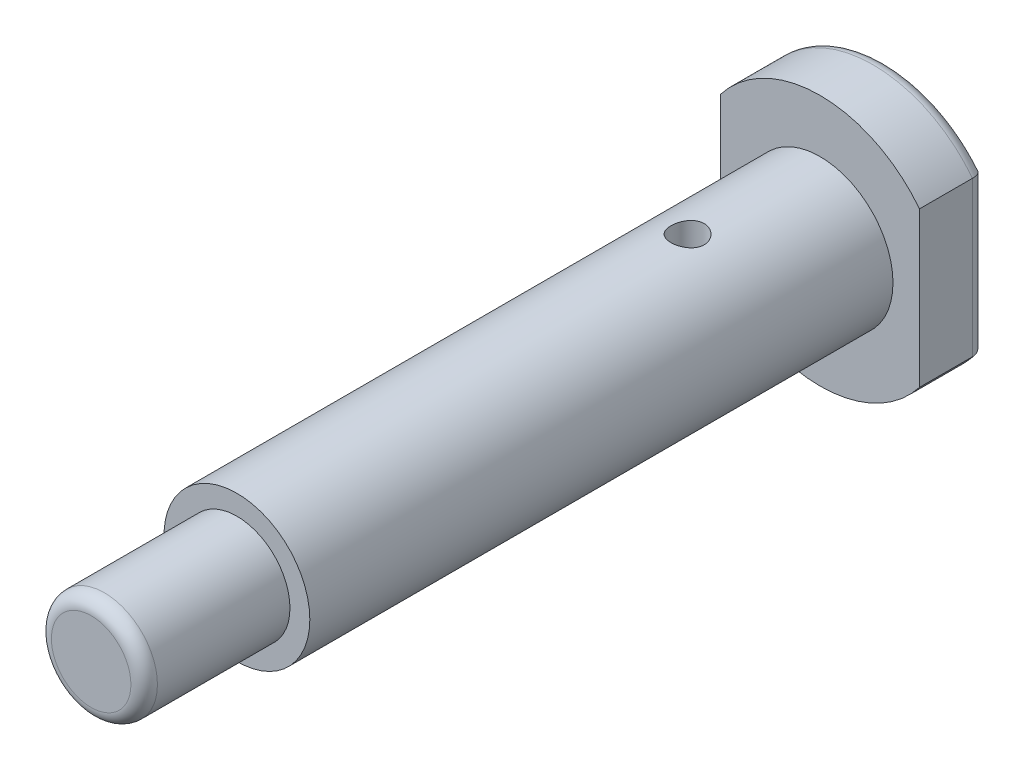
ISO-10303-21;
HEADER;
FILE_DESCRIPTION(('STEP AP214'),'2;1');
FILE_NAME('part.step','',(''),(''),'','','');
FILE_SCHEMA(('AUTOMOTIVE_DESIGN { 1 0 10303 214 1 1 1 1 }'));
ENDSEC;
DATA;
#1=APPLICATION_CONTEXT('core data for automotive mechanical design processes');
#2=APPLICATION_PROTOCOL_DEFINITION('international standard','automotive_design',2000,#1);
#3=PRODUCT_CONTEXT('',#1,'mechanical');
#4=PRODUCT('Part','Part','',(#3));
#5=PRODUCT_RELATED_PRODUCT_CATEGORY('part','',(#4));
#6=PRODUCT_DEFINITION_FORMATION('','',#4);
#7=PRODUCT_DEFINITION_CONTEXT('part definition',#1,'design');
#8=PRODUCT_DEFINITION('design','',#6,#7);
#9=PRODUCT_DEFINITION_SHAPE('','',#8);
#10=(LENGTH_UNIT() NAMED_UNIT(*) SI_UNIT(.MILLI.,.METRE.));
#11=(NAMED_UNIT(*) PLANE_ANGLE_UNIT() SI_UNIT($,.RADIAN.));
#12=(NAMED_UNIT(*) SI_UNIT($,.STERADIAN.) SOLID_ANGLE_UNIT());
#13=UNCERTAINTY_MEASURE_WITH_UNIT(LENGTH_MEASURE(1.E-05),#10,'distance_accuracy_value','');
#14=(GEOMETRIC_REPRESENTATION_CONTEXT(3) GLOBAL_UNCERTAINTY_ASSIGNED_CONTEXT((#13)) GLOBAL_UNIT_ASSIGNED_CONTEXT((#10,
#11,#12)) REPRESENTATION_CONTEXT('',''));
#15=CARTESIAN_POINT('',(0.,0.,0.));
#16=DIRECTION('',(0.,0.,1.));
#17=DIRECTION('',(1.,0.,0.));
#18=AXIS2_PLACEMENT_3D('',#15,#16,#17);
#19=CARTESIAN_POINT('',(-32.8522446417878,0.,120.));
#20=DIRECTION('',(0.,0.,-1.));
#21=DIRECTION('',(-1.,0.,0.));
#22=AXIS2_PLACEMENT_3D('',#19,#20,#21);
#23=CYLINDRICAL_SURFACE('',#22,8.);
#24=CARTESIAN_POINT('',(-32.8522446417878,0.,118.));
#25=DIRECTION('',(0.,0.,1.));
#26=DIRECTION('',(1.,0.,0.));
#27=AXIS2_PLACEMENT_3D('',#24,#25,#26);
#28=CIRCLE('',#27,8.);
#29=CARTESIAN_POINT('',(-24.8522446417878,0.,118.));
#30=VERTEX_POINT('',#29);
#31=EDGE_CURVE('E49',#30,#30,#28,.F.);
#32=ORIENTED_EDGE('',*,*,#31,.T.);
#33=EDGE_LOOP('',(#32));
#34=FACE_BOUND('',#33,.T.);
#35=CARTESIAN_POINT('',(-32.8522446417878,0.,98.));
#36=DIRECTION('',(0.,0.,1.));
#37=DIRECTION('',(1.,0.,0.));
#38=AXIS2_PLACEMENT_3D('',#35,#36,#37);
#39=CIRCLE('',#38,8.);
#40=CARTESIAN_POINT('',(-24.8522446417878,0.,98.));
#41=VERTEX_POINT('',#40);
#42=EDGE_CURVE('E139',#41,#41,#39,.T.);
#43=ORIENTED_EDGE('',*,*,#42,.T.);
#44=EDGE_LOOP('',(#43));
#45=FACE_BOUND('',#44,.T.);
#46=ADVANCED_FACE('F36',(#34,#45),#23,.T.);
#47=CARTESIAN_POINT('',(0.,0.,120.));
#48=DIRECTION('',(0.,0.,1.));
#49=DIRECTION('',(1.,0.,0.));
#50=AXIS2_PLACEMENT_3D('',#47,#48,#49);
#51=PLANE('',#50);
#52=CARTESIAN_POINT('',(-32.8522446417878,0.,120.));
#53=DIRECTION('',(0.,0.,1.));
#54=DIRECTION('',(1.,0.,0.));
#55=AXIS2_PLACEMENT_3D('',#52,#53,#54);
#56=CIRCLE('',#55,6.);
#57=CARTESIAN_POINT('',(-26.8522446417878,0.,120.));
#58=VERTEX_POINT('',#57);
#59=EDGE_CURVE('E156',#58,#58,#56,.T.);
#60=ORIENTED_EDGE('',*,*,#59,.T.);
#61=EDGE_LOOP('',(#60));
#62=FACE_BOUND('',#61,.T.);
#63=ADVANCED_FACE('F225',(#62),#51,.T.);
#64=CARTESIAN_POINT('',(-32.8522446417878,0.,98.));
#65=DIRECTION('',(0.,0.,-1.));
#66=DIRECTION('',(-1.,0.,0.));
#67=AXIS2_PLACEMENT_3D('',#64,#65,#66);
#68=CYLINDRICAL_SURFACE('',#67,11.);
#69=CARTESIAN_POINT('',(-32.8522446417878,-11.,32.5));
#70=CARTESIAN_POINT('',(-32.7137263631909,-10.9999974735185,32.4999954681736));
#71=CARTESIAN_POINT('',(-32.5751544695298,-10.9973570934613,32.4884487724231));
#72=CARTESIAN_POINT('',(-32.3019560471885,-10.987079320306,32.4426205239383));
#73=CARTESIAN_POINT('',(-32.1673322495671,-10.9794385496265,32.4083236040447));
#74=CARTESIAN_POINT('',(-31.9060169698029,-10.9600095312294,32.3181319513681));
#75=CARTESIAN_POINT('',(-31.7793170468314,-10.9482257885674,32.2622606720193));
#76=CARTESIAN_POINT('',(-31.5370923659622,-10.921778201627,32.1305828866191));
#77=CARTESIAN_POINT('',(-31.421567496756,-10.9071143860398,32.0547765791576));
#78=CARTESIAN_POINT('',(-31.2029770373414,-10.8762265816814,31.8839979553933));
#79=CARTESIAN_POINT('',(-31.1001317028673,-10.8599819758326,31.788747426525));
#80=CARTESIAN_POINT('',(-30.9117307436217,-10.827906511833,31.5823810258627));
#81=CARTESIAN_POINT('',(-30.82617676057,-10.8120756930933,31.4712636493055));
#82=CARTESIAN_POINT('',(-30.67379864777,-10.7824158369221,31.2346679447163));
#83=CARTESIAN_POINT('',(-30.6072120982221,-10.7686131580577,31.1090330036942));
#84=CARTESIAN_POINT('',(-30.4961839446091,-10.7448696147509,30.8479904994184));
#85=CARTESIAN_POINT('',(-30.4517394646103,-10.7349282488168,30.7125842079384));
#86=CARTESIAN_POINT('',(-30.3869911476606,-10.7202434469831,30.4382408128835));
#87=CARTESIAN_POINT('',(-30.3662957149803,-10.715415797339,30.2994007368775));
#88=CARTESIAN_POINT('',(-30.348414757273,-10.7112523406768,30.0201417727869));
#89=CARTESIAN_POINT('',(-30.3512261029223,-10.711915802658,29.8797230973377));
#90=CARTESIAN_POINT('',(-30.3799644722002,-10.7185835035919,29.6042271166513));
#91=CARTESIAN_POINT('',(-30.4054335957934,-10.7244819412976,29.4690990938051));
#92=CARTESIAN_POINT('',(-30.4780377925828,-10.7407873672743,29.2050855138452));
#93=CARTESIAN_POINT('',(-30.5251741677449,-10.7511946264744,29.0762003323728));
#94=CARTESIAN_POINT('',(-30.6401872977624,-10.7754474384537,28.8270593281895));
#95=CARTESIAN_POINT('',(-30.7082375209277,-10.7893215597825,28.7068864822363));
#96=CARTESIAN_POINT('',(-30.8630248625837,-10.8189276843241,28.4794974468889));
#97=CARTESIAN_POINT('',(-30.9497647194165,-10.8346599596346,28.3722831597361));
#98=CARTESIAN_POINT('',(-31.1418794617527,-10.8666615287251,28.171221438179));
#99=CARTESIAN_POINT('',(-31.2476429743595,-10.882934773515,28.0777455734837));
#100=CARTESIAN_POINT('',(-31.4735323433781,-10.9138502597158,27.9097941112929));
#101=CARTESIAN_POINT('',(-31.593658501697,-10.9284924668293,27.8353189133005));
#102=CARTESIAN_POINT('',(-31.8453366499887,-10.9545497424637,27.7073796120285));
#103=CARTESIAN_POINT('',(-31.9769158074397,-10.9659568484873,27.6539672263777));
#104=CARTESIAN_POINT('',(-32.2474995192961,-10.9841998956698,27.5701159941321));
#105=CARTESIAN_POINT('',(-32.3865029021241,-10.9910365557784,27.5396735341778));
#106=CARTESIAN_POINT('',(-32.6648048015951,-10.9992650071756,27.5031737625273));
#107=CARTESIAN_POINT('',(-32.8040335494508,-11.0007700184113,27.4966093086833));
#108=CARTESIAN_POINT('',(-33.0815985284679,-10.9984842255063,27.5066730398529));
#109=CARTESIAN_POINT('',(-33.2199348245087,-10.9946938107912,27.523299519406));
#110=CARTESIAN_POINT('',(-33.4900863190063,-10.9823148103741,27.5788531669054));
#111=CARTESIAN_POINT('',(-33.6219596786022,-10.973784087055,27.6175115464437));
#112=CARTESIAN_POINT('',(-33.8773485726654,-10.9528806132367,27.7157310274571));
#113=CARTESIAN_POINT('',(-34.0008633561107,-10.9405075180554,27.7752940042533));
#114=CARTESIAN_POINT('',(-34.2381054943484,-10.9130143275095,27.9146691435553));
#115=CARTESIAN_POINT('',(-34.351655327015,-10.8978552985532,27.9947756267732));
#116=CARTESIAN_POINT('',(-34.5638823775783,-10.866546095646,28.1725793284402));
#117=CARTESIAN_POINT('',(-34.6625574953675,-10.8503957821912,28.2702790265468));
#118=CARTESIAN_POINT('',(-34.8442617039688,-10.8185287714487,28.4828309651334));
#119=CARTESIAN_POINT('',(-34.9269383077284,-10.8028272119253,28.5979872417868));
#120=CARTESIAN_POINT('',(-35.0717827858533,-10.7740023321604,28.8408463906703));
#121=CARTESIAN_POINT('',(-35.133951566798,-10.7608788979592,28.9685487079596));
#122=CARTESIAN_POINT('',(-35.2355806142071,-10.7388274870674,29.2321804695689));
#123=CARTESIAN_POINT('',(-35.2751718040049,-10.7298753781702,29.3680573237433));
#124=CARTESIAN_POINT('',(-35.3308972251915,-10.7171411058581,29.6447669066991));
#125=CARTESIAN_POINT('',(-35.347035555204,-10.7133580391079,29.7855987651364));
#126=CARTESIAN_POINT('',(-35.3552120339295,-10.7114502943222,30.0646586193109));
#127=CARTESIAN_POINT('',(-35.3478101267985,-10.7131941458177,30.2028695993336));
#128=CARTESIAN_POINT('',(-35.3103757958206,-10.7218446846914,30.4760189101883));
#129=CARTESIAN_POINT('',(-35.2803436839579,-10.7287513008948,30.6109572861105));
#130=CARTESIAN_POINT('',(-35.1987815653939,-10.7468826027048,30.8732433973663));
#131=CARTESIAN_POINT('',(-35.1473392170678,-10.758089666867,31.0006196911415));
#132=CARTESIAN_POINT('',(-35.0244900078566,-10.783564723281,31.2450147069006));
#133=CARTESIAN_POINT('',(-34.9530808791,-10.7978330631966,31.3620322503255));
#134=CARTESIAN_POINT('',(-34.7904946106983,-10.828211072634,31.5851344276553));
#135=CARTESIAN_POINT('',(-34.6989210982162,-10.8443540558786,31.6909257222074));
#136=CARTESIAN_POINT('',(-34.499400931112,-10.8764454859305,31.8858231850819));
#137=CARTESIAN_POINT('',(-34.3914504771946,-10.8923938866665,31.974925470966));
#138=CARTESIAN_POINT('',(-34.1603852469384,-10.9225693389041,32.1351380602337));
#139=CARTESIAN_POINT('',(-34.037076263664,-10.9367686161711,32.2059738233331));
#140=CARTESIAN_POINT('',(-33.7800006094995,-10.9615640551399,32.3257999706629));
#141=CARTESIAN_POINT('',(-33.6462424861255,-10.9721631246672,32.3748079947867));
#142=CARTESIAN_POINT('',(-33.4024077133274,-10.9867559512784,32.4412279061761));
#143=CARTESIAN_POINT('',(-33.2936127529263,-10.9916908558499,32.4632239876893));
#144=CARTESIAN_POINT('',(-33.0739714567187,-10.9983138080738,32.4926114735793));
#145=CARTESIAN_POINT('',(-32.9631252265049,-11.0000020223883,32.5000036276192));
#146=CARTESIAN_POINT('',(-32.8522446417878,-11.,32.5));
#147=B_SPLINE_CURVE_WITH_KNOTS('',3,(#69,#70,#71,#72,#73,#74,#75,#76,#77,#78,#79,#80,#81,#82,
#83,#84,#85,#86,#87,#88,#89,#90,#91,#92,#93,#94,#95,#96,#97,#98,#99,#100,#101,#102,#103,#104,
#105,#106,#107,#108,#109,#110,#111,#112,#113,#114,#115,#116,#117,#118,#119,#120,#121,#122,#123,
#124,#125,#126,#127,#128,#129,#130,#131,#132,#133,#134,#135,#136,#137,#138,#139,#140,#141,#142,
#143,#144,#145,#146),.UNSPECIFIED.,.T.,.F.,(4,2,2,2,2,2,2,2,2,2,2,2,2,2,2,2,2,2,2,2,2,2,2,2,2,2,
2,2,2,2,2,2,2,2,2,2,2,2,4),(0.,0.415148849633316,0.830578406996924,1.24555761755318,
1.66053269430524,2.08192389396808,2.50335508365802,2.92985362973413,3.35629676538238,
3.77560244898081,4.19485231368756,4.60581714174234,5.0168066675397,5.43130157438849,
5.84585725297977,6.27011531803702,6.69438230269861,7.11968464096645,7.54492006169894,
7.96106941916761,8.37718817463626,8.78833576149034,9.19952024123082,9.61696129328766,
10.0344612272567,10.4603132154039,10.8861463755948,11.3094844190899,11.732748471094,
12.1460204395145,12.5592867105953,12.9708773657614,13.382514789318,13.8031102578591,
14.2238034502007,14.6504927745346,15.0768366452215,15.4091704772436,15.74148724914),.UNSPECIFIED.);
#148=CARTESIAN_POINT('',(-32.8522446417878,-11.,32.5));
#149=VERTEX_POINT('',#148);
#150=EDGE_CURVE('E40',#149,#149,#147,.T.);
#151=ORIENTED_EDGE('',*,*,#150,.T.);
#152=EDGE_LOOP('',(#151));
#153=FACE_BOUND('',#152,.T.);
#154=CARTESIAN_POINT('',(-32.8522446417878,11.,32.5));
#155=CARTESIAN_POINT('',(-32.9907629203847,10.9999974735185,32.4999954681736));
#156=CARTESIAN_POINT('',(-33.1293348140458,10.9973570934613,32.4884487724231));
#157=CARTESIAN_POINT('',(-33.4025332363871,10.987079320306,32.4426205239383));
#158=CARTESIAN_POINT('',(-33.5371570340085,10.9794385496265,32.4083236040447));
#159=CARTESIAN_POINT('',(-33.7984723137727,10.9600095312294,32.3181319513681));
#160=CARTESIAN_POINT('',(-33.9251722367443,10.9482257885674,32.2622606720193));
#161=CARTESIAN_POINT('',(-34.1673969176135,10.921778201627,32.1305828866191));
#162=CARTESIAN_POINT('',(-34.2829217868196,10.9071143860398,32.0547765791576));
#163=CARTESIAN_POINT('',(-34.5015122462342,10.8762265816814,31.8839979553933));
#164=CARTESIAN_POINT('',(-34.6043575807083,10.8599819758326,31.788747426525));
#165=CARTESIAN_POINT('',(-34.7927585399539,10.827906511833,31.5823810258628));
#166=CARTESIAN_POINT('',(-34.8783125230057,10.8120756930933,31.4712636493055));
#167=CARTESIAN_POINT('',(-35.0306906358057,10.7824158369221,31.2346679447163));
#168=CARTESIAN_POINT('',(-35.0972771853536,10.7686131580577,31.1090330036942));
#169=CARTESIAN_POINT('',(-35.2083053389665,10.7448696147509,30.8479904994184));
#170=CARTESIAN_POINT('',(-35.2527498189653,10.7349282488168,30.7125842079384));
#171=CARTESIAN_POINT('',(-35.317498135915,10.7202434469831,30.4382408128835));
#172=CARTESIAN_POINT('',(-35.3381935685954,10.715415797339,30.2994007368775));
#173=CARTESIAN_POINT('',(-35.3560745263027,10.7112523406768,30.0201417727869));
#174=CARTESIAN_POINT('',(-35.3532631806533,10.711915802658,29.8797230973377));
#175=CARTESIAN_POINT('',(-35.3245248113754,10.7185835035919,29.6042271166513));
#176=CARTESIAN_POINT('',(-35.2990556877822,10.7244819412976,29.4690990938051));
#177=CARTESIAN_POINT('',(-35.2264514909928,10.7407873672743,29.2050855138452));
#178=CARTESIAN_POINT('',(-35.1793151158307,10.7511946264744,29.0762003323728));
#179=CARTESIAN_POINT('',(-35.0643019858133,10.7754474384537,28.8270593281895));
#180=CARTESIAN_POINT('',(-34.9962517626479,10.7893215597825,28.7068864822363));
#181=CARTESIAN_POINT('',(-34.8414644209919,10.8189276843241,28.4794974468889));
#182=CARTESIAN_POINT('',(-34.7547245641592,10.8346599596346,28.3722831597361));
#183=CARTESIAN_POINT('',(-34.562609821823,10.8666615287251,28.171221438179));
#184=CARTESIAN_POINT('',(-34.4568463092161,10.882934773515,28.0777455734837));
#185=CARTESIAN_POINT('',(-34.2309569401975,10.9138502597158,27.9097941112929));
#186=CARTESIAN_POINT('',(-34.1108307818786,10.9284924668293,27.8353189133005));
#187=CARTESIAN_POINT('',(-33.859152633587,10.9545497424637,27.7073796120285));
#188=CARTESIAN_POINT('',(-33.727573476136,10.9659568484873,27.6539672263777));
#189=CARTESIAN_POINT('',(-33.4569897642795,10.9841998956698,27.5701159941321));
#190=CARTESIAN_POINT('',(-33.3179863814515,10.9910365557784,27.5396735341778));
#191=CARTESIAN_POINT('',(-33.0396844819806,10.9992650071756,27.5031737625273));
#192=CARTESIAN_POINT('',(-32.9004557341249,11.0007700184113,27.4966093086833));
#193=CARTESIAN_POINT('',(-32.6228907551077,10.9984842255063,27.5066730398529));
#194=CARTESIAN_POINT('',(-32.484554459067,10.9946938107912,27.523299519406));
#195=CARTESIAN_POINT('',(-32.2144029645694,10.9823148103741,27.5788531669054));
#196=CARTESIAN_POINT('',(-32.0825296049734,10.973784087055,27.6175115464437));
#197=CARTESIAN_POINT('',(-31.8271407109102,10.9528806132367,27.7157310274571));
#198=CARTESIAN_POINT('',(-31.7036259274649,10.9405075180554,27.7752940042533));
#199=CARTESIAN_POINT('',(-31.4663837892273,10.9130143275095,27.9146691435553));
#200=CARTESIAN_POINT('',(-31.3528339565606,10.8978552985532,27.9947756267732));
#201=CARTESIAN_POINT('',(-31.1406069059973,10.866546095646,28.1725793284402));
#202=CARTESIAN_POINT('',(-31.0419317882081,10.8503957821912,28.2702790265468));
#203=CARTESIAN_POINT('',(-30.8602275796069,10.8185287714487,28.4828309651334));
#204=CARTESIAN_POINT('',(-30.7775509758472,10.8028272119253,28.5979872417868));
#205=CARTESIAN_POINT('',(-30.6327064977223,10.7740023321604,28.8408463906703));
#206=CARTESIAN_POINT('',(-30.5705377167777,10.7608788979592,28.9685487079596));
#207=CARTESIAN_POINT('',(-30.4689086693685,10.7388274870674,29.2321804695689));
#208=CARTESIAN_POINT('',(-30.4293174795708,10.7298753781702,29.3680573237433));
#209=CARTESIAN_POINT('',(-30.3735920583842,10.7171411058581,29.6447669066991));
#210=CARTESIAN_POINT('',(-30.3574537283717,10.7133580391079,29.7855987651364));
#211=CARTESIAN_POINT('',(-30.3492772496462,10.7114502943222,30.0646586193109));
#212=CARTESIAN_POINT('',(-30.3566791567771,10.7131941458177,30.2028695993336));
#213=CARTESIAN_POINT('',(-30.394113487755,10.7218446846914,30.4760189101883));
#214=CARTESIAN_POINT('',(-30.4241455996177,10.7287513008948,30.6109572861105));
#215=CARTESIAN_POINT('',(-30.5057077181817,10.7468826027048,30.8732433973663));
#216=CARTESIAN_POINT('',(-30.5571500665079,10.758089666867,31.0006196911415));
#217=CARTESIAN_POINT('',(-30.679999275719,10.783564723281,31.2450147069006));
#218=CARTESIAN_POINT('',(-30.7514084044756,10.7978330631966,31.3620322503255));
#219=CARTESIAN_POINT('',(-30.9139946728773,10.828211072634,31.5851344276553));
#220=CARTESIAN_POINT('',(-31.0055681853595,10.8443540558786,31.6909257222074));
#221=CARTESIAN_POINT('',(-31.2050883524636,10.8764454859305,31.8858231850819));
#222=CARTESIAN_POINT('',(-31.3130388063811,10.8923938866665,31.974925470966));
#223=CARTESIAN_POINT('',(-31.5441040366373,10.9225693389041,32.1351380602337));
#224=CARTESIAN_POINT('',(-31.6674130199116,10.9367686161711,32.2059738233331));
#225=CARTESIAN_POINT('',(-31.9244886740761,10.9615640551399,32.3257999706629));
#226=CARTESIAN_POINT('',(-32.0582467974501,10.9721631246672,32.3748079947867));
#227=CARTESIAN_POINT('',(-32.3020815702482,10.9867559512784,32.4412279061761));
#228=CARTESIAN_POINT('',(-32.4108765306493,10.9916908558499,32.4632239876893));
#229=CARTESIAN_POINT('',(-32.6305178268569,10.9983138080738,32.4926114735793));
#230=CARTESIAN_POINT('',(-32.7413640570707,11.0000020223883,32.5000036276192));
#231=CARTESIAN_POINT('',(-32.8522446417878,11.,32.5));
#232=B_SPLINE_CURVE_WITH_KNOTS('',3,(#154,#155,#156,#157,#158,#159,#160,#161,#162,#163,#164,
#165,#166,#167,#168,#169,#170,#171,#172,#173,#174,#175,#176,#177,#178,#179,#180,#181,#182,#183,
#184,#185,#186,#187,#188,#189,#190,#191,#192,#193,#194,#195,#196,#197,#198,#199,#200,#201,#202,
#203,#204,#205,#206,#207,#208,#209,#210,#211,#212,#213,#214,#215,#216,#217,#218,#219,#220,#221,
#222,#223,#224,#225,#226,#227,#228,#229,#230,#231),.UNSPECIFIED.,.T.,.F.,(4,2,2,2,2,2,2,2,2,2,2,
2,2,2,2,2,2,2,2,2,2,2,2,2,2,2,2,2,2,2,2,2,2,2,2,2,2,2,4),(0.,0.415148849633316,
0.830578406996923,1.24555761755318,1.66053269430524,2.08192389396808,2.50335508365802,
2.92985362973414,3.35629676538239,3.77560244898081,4.19485231368757,4.60581714174234,
5.01680666753971,5.43130157438849,5.84585725297977,6.27011531803703,6.69438230269861,
7.11968464096647,7.54492006169894,7.96106941916761,8.37718817463626,8.78833576149035,
9.19952024123083,9.61696129328767,10.0344612272567,10.4603132154039,10.8861463755948,
11.3094844190899,11.732748471094,12.1460204395145,12.5592867105953,12.9708773657615,
13.382514789318,13.8031102578591,14.2238034502007,14.6504927745346,15.0768366452215,
15.4091704772436,15.74148724914),.UNSPECIFIED.);
#233=CARTESIAN_POINT('',(-32.8522446417878,11.,32.5));
#234=VERTEX_POINT('',#233);
#235=EDGE_CURVE('E11',#234,#234,#232,.T.);
#236=ORIENTED_EDGE('',*,*,#235,.T.);
#237=EDGE_LOOP('',(#236));
#238=FACE_BOUND('',#237,.T.);
#239=CARTESIAN_POINT('',(-32.8522446417878,0.,10.));
#240=DIRECTION('',(0.,0.,1.));
#241=DIRECTION('',(1.,0.,0.));
#242=AXIS2_PLACEMENT_3D('',#239,#240,#241);
#243=CIRCLE('',#242,11.);
#244=CARTESIAN_POINT('',(-21.8522446417878,0.,10.));
#245=VERTEX_POINT('',#244);
#246=EDGE_CURVE('E133',#245,#245,#243,.T.);
#247=ORIENTED_EDGE('',*,*,#246,.T.);
#248=EDGE_LOOP('',(#247));
#249=FACE_BOUND('',#248,.T.);
#250=CARTESIAN_POINT('',(-32.8522446417878,0.,98.));
#251=DIRECTION('',(0.,0.,1.));
#252=DIRECTION('',(1.,0.,0.));
#253=AXIS2_PLACEMENT_3D('',#250,#251,#252);
#254=CIRCLE('',#253,11.);
#255=CARTESIAN_POINT('',(-21.8522446417878,0.,98.));
#256=VERTEX_POINT('',#255);
#257=EDGE_CURVE('E136',#256,#256,#254,.T.);
#258=ORIENTED_EDGE('',*,*,#257,.F.);
#259=EDGE_LOOP('',(#258));
#260=FACE_BOUND('',#259,.T.);
#261=ADVANCED_FACE('F197',(#153,#238,#249,#260),#68,.T.);
#262=CARTESIAN_POINT('',(0.,0.,98.));
#263=DIRECTION('',(0.,0.,1.));
#264=DIRECTION('',(1.,0.,0.));
#265=AXIS2_PLACEMENT_3D('',#262,#263,#264);
#266=PLANE('',#265);
#267=ORIENTED_EDGE('',*,*,#257,.T.);
#268=EDGE_LOOP('',(#267));
#269=FACE_BOUND('',#268,.T.);
#270=ORIENTED_EDGE('',*,*,#42,.F.);
#271=EDGE_LOOP('',(#270));
#272=FACE_BOUND('',#271,.T.);
#273=ADVANCED_FACE('F219',(#269,#272),#266,.T.);
#274=CARTESIAN_POINT('',(-47.8522446417878,0.,10.));
#275=DIRECTION('',(-1.,0.,0.));
#276=DIRECTION('',(0.,0.,1.));
#277=AXIS2_PLACEMENT_3D('',#274,#275,#276);
#278=PLANE('',#277);
#279=DIRECTION('',(0.,0.,-1.));
#280=VECTOR('',#279,1.);
#281=CARTESIAN_POINT('',(-47.8522446417878,11.6619037896906,10.));
#282=LINE('',#281,#280);
#283=CARTESIAN_POINT('',(-47.8522446417878,11.6619037896906,10.));
#284=VERTEX_POINT('',#283);
#285=CARTESIAN_POINT('',(-47.8522446417878,11.6619037896906,2.));
#286=VERTEX_POINT('',#285);
#287=EDGE_CURVE('E129',#284,#286,#282,.T.);
#288=ORIENTED_EDGE('',*,*,#287,.T.);
#289=DIRECTION('',(0.,1.,0.));
#290=VECTOR('',#289,1.);
#291=CARTESIAN_POINT('',(-47.8522446417878,-11.6619037896906,2.));
#292=LINE('',#291,#290);
#293=CARTESIAN_POINT('',(-47.8522446417878,-11.6619037896906,2.));
#294=VERTEX_POINT('',#293);
#295=EDGE_CURVE('E114',#286,#294,#292,.F.);
#296=ORIENTED_EDGE('',*,*,#295,.T.);
#297=DIRECTION('',(0.,0.,-1.));
#298=VECTOR('',#297,1.);
#299=CARTESIAN_POINT('',(-47.8522446417878,-11.6619037896906,10.));
#300=LINE('',#299,#298);
#301=CARTESIAN_POINT('',(-47.8522446417878,-11.6619037896906,10.));
#302=VERTEX_POINT('',#301);
#303=EDGE_CURVE('E111',#302,#294,#300,.T.);
#304=ORIENTED_EDGE('',*,*,#303,.F.);
#305=DIRECTION('',(0.,1.,0.));
#306=VECTOR('',#305,1.);
#307=CARTESIAN_POINT('',(-47.8522446417878,0.,10.));
#308=LINE('',#307,#306);
#309=EDGE_CURVE('E97',#302,#284,#308,.T.);
#310=ORIENTED_EDGE('',*,*,#309,.T.);
#311=EDGE_LOOP('',(#288,#296,#304,#310));
#312=FACE_BOUND('',#311,.T.);
#313=ADVANCED_FACE('F112',(#312),#278,.T.);
#314=CARTESIAN_POINT('',(-17.8522446417878,0.,10.));
#315=DIRECTION('',(-1.,0.,0.));
#316=DIRECTION('',(0.,0.,1.));
#317=AXIS2_PLACEMENT_3D('',#314,#315,#316);
#318=PLANE('',#317);
#319=DIRECTION('',(0.,0.,-1.));
#320=VECTOR('',#319,1.);
#321=CARTESIAN_POINT('',(-17.8522446417878,-11.6619037896906,10.));
#322=LINE('',#321,#320);
#323=CARTESIAN_POINT('',(-17.8522446417878,-11.6619037896906,10.));
#324=VERTEX_POINT('',#323);
#325=CARTESIAN_POINT('',(-17.8522446417878,-11.6619037896906,2.));
#326=VERTEX_POINT('',#325);
#327=EDGE_CURVE('E118',#324,#326,#322,.T.);
#328=ORIENTED_EDGE('',*,*,#327,.T.);
#329=DIRECTION('',(0.,1.,0.));
#330=VECTOR('',#329,1.);
#331=CARTESIAN_POINT('',(-17.8522446417878,0.,2.));
#332=LINE('',#331,#330);
#333=CARTESIAN_POINT('',(-17.8522446417878,11.6619037896906,2.));
#334=VERTEX_POINT('',#333);
#335=EDGE_CURVE('E64',#326,#334,#332,.T.);
#336=ORIENTED_EDGE('',*,*,#335,.T.);
#337=DIRECTION('',(0.,0.,-1.));
#338=VECTOR('',#337,1.);
#339=CARTESIAN_POINT('',(-17.8522446417878,11.6619037896906,10.));
#340=LINE('',#339,#338);
#341=CARTESIAN_POINT('',(-17.8522446417878,11.6619037896906,10.));
#342=VERTEX_POINT('',#341);
#343=EDGE_CURVE('E108',#342,#334,#340,.T.);
#344=ORIENTED_EDGE('',*,*,#343,.F.);
#345=DIRECTION('',(0.,1.,0.));
#346=VECTOR('',#345,1.);
#347=CARTESIAN_POINT('',(-17.8522446417878,0.,10.));
#348=LINE('',#347,#346);
#349=EDGE_CURVE('E107',#324,#342,#348,.T.);
#350=ORIENTED_EDGE('',*,*,#349,.F.);
#351=EDGE_LOOP('',(#328,#336,#344,#350));
#352=FACE_BOUND('',#351,.T.);
#353=ADVANCED_FACE('F215',(#352),#318,.F.);
#354=CARTESIAN_POINT('',(0.,0.,10.));
#355=DIRECTION('',(0.,0.,1.));
#356=DIRECTION('',(1.,0.,0.));
#357=AXIS2_PLACEMENT_3D('',#354,#355,#356);
#358=PLANE('',#357);
#359=ORIENTED_EDGE('',*,*,#309,.F.);
#360=CARTESIAN_POINT('',(-32.8522446417878,0.,10.));
#361=DIRECTION('',(0.,0.,1.));
#362=DIRECTION('',(1.,0.,0.));
#363=AXIS2_PLACEMENT_3D('',#360,#361,#362);
#364=CIRCLE('',#363,19.);
#365=EDGE_CURVE('E102',#302,#324,#364,.T.);
#366=ORIENTED_EDGE('',*,*,#365,.T.);
#367=ORIENTED_EDGE('',*,*,#349,.T.);
#368=CARTESIAN_POINT('',(-32.8522446417878,0.,10.));
#369=DIRECTION('',(0.,0.,1.));
#370=DIRECTION('',(1.,0.,0.));
#371=AXIS2_PLACEMENT_3D('',#368,#369,#370);
#372=CIRCLE('',#371,19.);
#373=EDGE_CURVE('E105',#342,#284,#372,.T.);
#374=ORIENTED_EDGE('',*,*,#373,.T.);
#375=EDGE_LOOP('',(#359,#366,#367,#374));
#376=FACE_BOUND('',#375,.T.);
#377=ORIENTED_EDGE('',*,*,#246,.F.);
#378=EDGE_LOOP('',(#377));
#379=FACE_BOUND('',#378,.T.);
#380=ADVANCED_FACE('F99',(#376,#379),#358,.T.);
#381=CARTESIAN_POINT('',(0.,0.,0.));
#382=DIRECTION('',(0.,0.,1.));
#383=DIRECTION('',(1.,0.,0.));
#384=AXIS2_PLACEMENT_3D('',#381,#382,#383);
#385=PLANE('',#384);
#386=DIRECTION('',(0.,1.,0.));
#387=VECTOR('',#386,1.);
#388=CARTESIAN_POINT('',(-19.8522446417878,0.,0.));
#389=LINE('',#388,#387);
#390=CARTESIAN_POINT('',(-19.8522446417878,10.9544511501033,0.));
#391=VERTEX_POINT('',#390);
#392=CARTESIAN_POINT('',(-19.8522446417878,-10.9544511501033,0.));
#393=VERTEX_POINT('',#392);
#394=EDGE_CURVE('E148',#391,#393,#389,.F.);
#395=ORIENTED_EDGE('',*,*,#394,.T.);
#396=CARTESIAN_POINT('',(-32.8522446417878,0.,0.));
#397=DIRECTION('',(0.,0.,1.));
#398=DIRECTION('',(1.,0.,0.));
#399=AXIS2_PLACEMENT_3D('',#396,#397,#398);
#400=CIRCLE('',#399,17.);
#401=CARTESIAN_POINT('',(-45.8522446417878,-10.9544511501033,0.));
#402=VERTEX_POINT('',#401);
#403=EDGE_CURVE('E150',#393,#402,#400,.F.);
#404=ORIENTED_EDGE('',*,*,#403,.T.);
#405=DIRECTION('',(0.,1.,0.));
#406=VECTOR('',#405,1.);
#407=CARTESIAN_POINT('',(-45.8522446417878,11.6619037896906,0.));
#408=LINE('',#407,#406);
#409=CARTESIAN_POINT('',(-45.8522446417878,10.9544511501033,0.));
#410=VERTEX_POINT('',#409);
#411=EDGE_CURVE('E144',#402,#410,#408,.T.);
#412=ORIENTED_EDGE('',*,*,#411,.T.);
#413=CARTESIAN_POINT('',(-32.8522446417878,0.,0.));
#414=DIRECTION('',(0.,0.,1.));
#415=DIRECTION('',(1.,0.,0.));
#416=AXIS2_PLACEMENT_3D('',#413,#414,#415);
#417=CIRCLE('',#416,17.);
#418=EDGE_CURVE('E146',#410,#391,#417,.F.);
#419=ORIENTED_EDGE('',*,*,#418,.T.);
#420=EDGE_LOOP('',(#395,#404,#412,#419));
#421=FACE_BOUND('',#420,.T.);
#422=ADVANCED_FACE('F212',(#421),#385,.F.);
#423=CARTESIAN_POINT('',(-32.8522446417878,0.,10.));
#424=DIRECTION('',(0.,0.,-1.));
#425=DIRECTION('',(-1.,0.,0.));
#426=AXIS2_PLACEMENT_3D('',#423,#424,#425);
#427=CYLINDRICAL_SURFACE('',#426,19.);
#428=ORIENTED_EDGE('',*,*,#343,.T.);
#429=CARTESIAN_POINT('',(-32.8522446417878,0.,2.));
#430=DIRECTION('',(0.,0.,1.));
#431=DIRECTION('',(1.,0.,0.));
#432=AXIS2_PLACEMENT_3D('',#429,#430,#431);
#433=CIRCLE('',#432,19.);
#434=EDGE_CURVE('E56',#334,#286,#433,.T.);
#435=ORIENTED_EDGE('',*,*,#434,.T.);
#436=ORIENTED_EDGE('',*,*,#287,.F.);
#437=ORIENTED_EDGE('',*,*,#373,.F.);
#438=EDGE_LOOP('',(#428,#435,#436,#437));
#439=FACE_BOUND('',#438,.T.);
#440=ADVANCED_FACE('F209',(#439),#427,.T.);
#441=CARTESIAN_POINT('',(-32.8522446417878,0.,10.));
#442=DIRECTION('',(0.,0.,-1.));
#443=DIRECTION('',(-1.,0.,0.));
#444=AXIS2_PLACEMENT_3D('',#441,#442,#443);
#445=CYLINDRICAL_SURFACE('',#444,19.);
#446=ORIENTED_EDGE('',*,*,#303,.T.);
#447=CARTESIAN_POINT('',(-32.8522446417878,0.,2.));
#448=DIRECTION('',(0.,0.,1.));
#449=DIRECTION('',(1.,0.,0.));
#450=AXIS2_PLACEMENT_3D('',#447,#448,#449);
#451=CIRCLE('',#450,19.);
#452=EDGE_CURVE('E142',#294,#326,#451,.T.);
#453=ORIENTED_EDGE('',*,*,#452,.T.);
#454=ORIENTED_EDGE('',*,*,#327,.F.);
#455=ORIENTED_EDGE('',*,*,#365,.F.);
#456=EDGE_LOOP('',(#446,#453,#454,#455));
#457=FACE_BOUND('',#456,.T.);
#458=ADVANCED_FACE('F120',(#457),#445,.T.);
#459=CARTESIAN_POINT('',(-32.8522446417878,0.,2.));
#460=DIRECTION('',(0.,0.,1.));
#461=DIRECTION('',(1.,0.,0.));
#462=AXIS2_PLACEMENT_3D('',#459,#460,#461);
#463=TOROIDAL_SURFACE('',#462,17.,2.);
#464=CARTESIAN_POINT('',(-17.8522446417878,11.6619037896906,2.));
#465=CARTESIAN_POINT('',(-17.8522377637765,11.6619058462769,1.94598171971915));
#466=CARTESIAN_POINT('',(-17.854433012608,11.6611531769249,1.89196688865082));
#467=CARTESIAN_POINT('',(-17.8631749177118,11.6581543096388,1.78434023643365));
#468=CARTESIAN_POINT('',(-17.8697209116589,11.6559083390339,1.73072835519881));
#469=CARTESIAN_POINT('',(-17.8870930204596,11.6499451236759,1.62440008352148));
#470=CARTESIAN_POINT('',(-17.8979100141783,11.6462310142571,1.57168203282276));
#471=CARTESIAN_POINT('',(-17.9237113126995,11.6373659438458,1.4674140016757));
#472=CARTESIAN_POINT('',(-17.9386956498441,11.6322149717021,1.41586403029601));
#473=CARTESIAN_POINT('',(-17.9897131111544,11.6146627675983,1.26351051904033));
#474=CARTESIAN_POINT('',(-18.0318272094093,11.6001565947633,1.16490349655335));
#475=CARTESIAN_POINT('',(-18.1307369426246,11.5659998008216,0.976396320055426));
#476=CARTESIAN_POINT('',(-18.187535330986,11.5463482149073,0.88649780329705));
#477=CARTESIAN_POINT('',(-18.3153506369585,11.5019847666568,0.715640391958594));
#478=CARTESIAN_POINT('',(-18.3866517524167,11.4771714903434,0.63492044965898));
#479=CARTESIAN_POINT('',(-18.5404253697054,11.4234528370159,0.486541433308141));
#480=CARTESIAN_POINT('',(-18.6229014015198,11.3945461668311,0.418886502736701));
#481=CARTESIAN_POINT('',(-18.8011348030807,11.3318097138682,0.294844580377951));
#482=CARTESIAN_POINT('',(-18.8973569893139,11.2978032313887,0.239215707557156));
#483=CARTESIAN_POINT('',(-19.0968080874028,11.2269650761508,0.144876231263438));
#484=CARTESIAN_POINT('',(-19.2000378725171,11.19013305121,0.106167740828174));
#485=CARTESIAN_POINT('',(-19.392917013524,11.1209536501872,0.0513295217370644));
#486=CARTESIAN_POINT('',(-19.4819185441355,11.0888982991837,0.0324919595402663));
#487=CARTESIAN_POINT('',(-19.6612486768886,11.0240199391161,0.00708917108899187));
#488=CARTESIAN_POINT('',(-19.7515743412787,10.9911985550248,0.000500001400889955));
#489=CARTESIAN_POINT('',(-19.8452671302519,10.9569987564016,9.10686645752216E-06));
#490=CARTESIAN_POINT('',(-19.8487560024141,10.9557250227325,-2.26033852268268E-08));
#491=CARTESIAN_POINT('',(-19.8522446417878,10.9544511501033,0.));
#492=B_SPLINE_CURVE_WITH_KNOTS('',3,(#464,#465,#466,#467,#468,#469,#470,#471,#472,#473,#474,
#475,#476,#477,#478,#479,#480,#481,#482,#483,#484,#485,#486,#487,#488,#489,#490,#491),
.UNSPECIFIED.,.F.,.F.,(4,2,2,2,2,2,2,2,2,2,2,2,2,4),(0.,0.1619990349056,0.323973413925237,
0.485603735799528,0.647235312096193,0.970198102340865,1.29322149420745,1.62332056144323,
1.95352414604667,2.30070391470498,2.64792702721168,2.93655798245767,3.22462411964253,
3.23576643523815),.UNSPECIFIED.);
#493=EDGE_CURVE('E125',#391,#334,#492,.F.);
#494=ORIENTED_EDGE('',*,*,#493,.F.);
#495=ORIENTED_EDGE('',*,*,#418,.F.);
#496=CARTESIAN_POINT('',(-47.8522446417878,11.6619037896906,2.));
#497=CARTESIAN_POINT('',(-47.8522515197992,11.6619058462769,1.94598171971915));
#498=CARTESIAN_POINT('',(-47.8500562709676,11.6611531769249,1.89196688865082));
#499=CARTESIAN_POINT('',(-47.8413143658638,11.6581543096389,1.78434023643365));
#500=CARTESIAN_POINT('',(-47.8347683719168,11.6559083390339,1.73072835519881));
#501=CARTESIAN_POINT('',(-47.817396263116,11.6499451236759,1.62440008352148));
#502=CARTESIAN_POINT('',(-47.8065792693973,11.6462310142571,1.57168203282276));
#503=CARTESIAN_POINT('',(-47.7807779708761,11.6373659438458,1.4674140016757));
#504=CARTESIAN_POINT('',(-47.7657936337315,11.6322149717021,1.41586403029601));
#505=CARTESIAN_POINT('',(-47.7147761724212,11.6146627675983,1.26351051904033));
#506=CARTESIAN_POINT('',(-47.6726620741664,11.6001565947633,1.16490349655335));
#507=CARTESIAN_POINT('',(-47.573752340951,11.5659998008216,0.976396320055425));
#508=CARTESIAN_POINT('',(-47.5169539525896,11.5463482149073,0.88649780329705));
#509=CARTESIAN_POINT('',(-47.3891386466172,11.5019847666568,0.715640391958594));
#510=CARTESIAN_POINT('',(-47.317837531159,11.4771714903434,0.634920449658981));
#511=CARTESIAN_POINT('',(-47.1640639138702,11.4234528370159,0.486541433308142));
#512=CARTESIAN_POINT('',(-47.0815878820559,11.3945461668311,0.418886502736702));
#513=CARTESIAN_POINT('',(-46.903354480495,11.3318097138682,0.294844580377952));
#514=CARTESIAN_POINT('',(-46.8071322942617,11.2978032313888,0.239215707557156));
#515=CARTESIAN_POINT('',(-46.6076811961729,11.2269650761508,0.144876231263439));
#516=CARTESIAN_POINT('',(-46.5044514110586,11.19013305121,0.106167740828176));
#517=CARTESIAN_POINT('',(-46.3115722700517,11.1209536501872,0.0513295217370655));
#518=CARTESIAN_POINT('',(-46.2225707394401,11.0888982991837,0.0324919595402674));
#519=CARTESIAN_POINT('',(-46.043240606687,11.0240199391161,0.00708917108899273));
#520=CARTESIAN_POINT('',(-45.952914942297,10.9911985550247,0.000500001400890532));
#521=CARTESIAN_POINT('',(-45.8592221533237,10.9569987564015,9.10686645754993E-06));
#522=CARTESIAN_POINT('',(-45.8557332811615,10.9557250227325,-2.26033852193517E-08));
#523=CARTESIAN_POINT('',(-45.8522446417878,10.9544511501033,0.));
#524=B_SPLINE_CURVE_WITH_KNOTS('',3,(#496,#497,#498,#499,#500,#501,#502,#503,#504,#505,#506,
#507,#508,#509,#510,#511,#512,#513,#514,#515,#516,#517,#518,#519,#520,#521,#522,#523),
.UNSPECIFIED.,.F.,.F.,(4,2,2,2,2,2,2,2,2,2,2,2,2,4),(0.,0.1619990349056,0.323973413925236,
0.485603735799526,0.647235312096194,0.970198102340865,1.29322149420745,1.62332056144323,
1.95352414604667,2.30070391470498,2.64792702721167,2.93655798245767,3.22462411964252,
3.23576643523815),.UNSPECIFIED.);
#525=EDGE_CURVE('E121',#286,#410,#524,.T.);
#526=ORIENTED_EDGE('',*,*,#525,.F.);
#527=ORIENTED_EDGE('',*,*,#434,.F.);
#528=EDGE_LOOP('',(#494,#495,#526,#527));
#529=FACE_BOUND('',#528,.T.);
#530=ADVANCED_FACE('F181',(#529),#463,.T.);
#531=CARTESIAN_POINT('',(-45.8522446417878,0.,2.));
#532=DIRECTION('',(0.,-1.,0.));
#533=DIRECTION('',(0.,0.,-1.));
#534=AXIS2_PLACEMENT_3D('',#531,#532,#533);
#535=CYLINDRICAL_SURFACE('',#534,2.);
#536=ORIENTED_EDGE('',*,*,#525,.T.);
#537=ORIENTED_EDGE('',*,*,#411,.F.);
#538=CARTESIAN_POINT('',(-47.8522446417878,-11.6619037896906,2.));
#539=CARTESIAN_POINT('',(-47.8522515197992,-11.6619058462769,1.94598171971915));
#540=CARTESIAN_POINT('',(-47.8500562709676,-11.6611531769249,1.89196688865082));
#541=CARTESIAN_POINT('',(-47.8413143658638,-11.6581543096389,1.78434023643365));
#542=CARTESIAN_POINT('',(-47.8347683719168,-11.6559083390339,1.73072835519881));
#543=CARTESIAN_POINT('',(-47.817396263116,-11.6499451236759,1.62440008352148));
#544=CARTESIAN_POINT('',(-47.8065792693973,-11.6462310142571,1.57168203282276));
#545=CARTESIAN_POINT('',(-47.7807779708761,-11.6373659438458,1.4674140016757));
#546=CARTESIAN_POINT('',(-47.7657936337315,-11.6322149717021,1.41586403029601));
#547=CARTESIAN_POINT('',(-47.7147761724212,-11.6146627675983,1.26351051904033));
#548=CARTESIAN_POINT('',(-47.6726620741664,-11.6001565947633,1.16490349655335));
#549=CARTESIAN_POINT('',(-47.573752340951,-11.5659998008216,0.976396320055425));
#550=CARTESIAN_POINT('',(-47.5169539525896,-11.5463482149073,0.88649780329705));
#551=CARTESIAN_POINT('',(-47.3891386466172,-11.5019847666568,0.715640391958594));
#552=CARTESIAN_POINT('',(-47.317837531159,-11.4771714903434,0.634920449658981));
#553=CARTESIAN_POINT('',(-47.1640639138702,-11.4234528370159,0.486541433308142));
#554=CARTESIAN_POINT('',(-47.0815878820559,-11.3945461668311,0.418886502736702));
#555=CARTESIAN_POINT('',(-46.903354480495,-11.3318097138682,0.294844580377952));
#556=CARTESIAN_POINT('',(-46.8071322942617,-11.2978032313888,0.239215707557156));
#557=CARTESIAN_POINT('',(-46.6076811961729,-11.2269650761508,0.144876231263439));
#558=CARTESIAN_POINT('',(-46.5044514110586,-11.19013305121,0.106167740828176));
#559=CARTESIAN_POINT('',(-46.3115722700517,-11.1209536501872,0.0513295217370655));
#560=CARTESIAN_POINT('',(-46.2225707394401,-11.0888982991837,0.0324919595402674));
#561=CARTESIAN_POINT('',(-46.043240606687,-11.0240199391161,0.00708917108899273));
#562=CARTESIAN_POINT('',(-45.952914942297,-10.9911985550247,0.000500001400890532));
#563=CARTESIAN_POINT('',(-45.8592221533237,-10.9569987564015,9.10686645754993E-06));
#564=CARTESIAN_POINT('',(-45.8557332811615,-10.9557250227325,-2.26033852193517E-08));
#565=CARTESIAN_POINT('',(-45.8522446417878,-10.9544511501033,0.));
#566=B_SPLINE_CURVE_WITH_KNOTS('',3,(#538,#539,#540,#541,#542,#543,#544,#545,#546,#547,#548,
#549,#550,#551,#552,#553,#554,#555,#556,#557,#558,#559,#560,#561,#562,#563,#564,#565),
.UNSPECIFIED.,.F.,.F.,(4,2,2,2,2,2,2,2,2,2,2,2,2,4),(0.,0.1619990349056,0.323973413925236,
0.485603735799526,0.647235312096194,0.970198102340865,1.29322149420745,1.62332056144323,
1.95352414604667,2.30070391470498,2.64792702721167,2.93655798245767,3.22462411964252,
3.23576643523815),.UNSPECIFIED.);
#567=EDGE_CURVE('E164',#294,#402,#566,.T.);
#568=ORIENTED_EDGE('',*,*,#567,.F.);
#569=ORIENTED_EDGE('',*,*,#295,.F.);
#570=EDGE_LOOP('',(#536,#537,#568,#569));
#571=FACE_BOUND('',#570,.T.);
#572=ADVANCED_FACE('F177',(#571),#535,.T.);
#573=CARTESIAN_POINT('',(-19.8522446417878,0.,2.));
#574=DIRECTION('',(0.,1.,0.));
#575=DIRECTION('',(0.,0.,1.));
#576=AXIS2_PLACEMENT_3D('',#573,#574,#575);
#577=CYLINDRICAL_SURFACE('',#576,2.);
#578=ORIENTED_EDGE('',*,*,#493,.T.);
#579=ORIENTED_EDGE('',*,*,#335,.F.);
#580=CARTESIAN_POINT('',(-17.8522446417878,-11.6619037896906,2.));
#581=CARTESIAN_POINT('',(-17.8522377637765,-11.6619058462769,1.94598171971915));
#582=CARTESIAN_POINT('',(-17.854433012608,-11.6611531769249,1.89196688865082));
#583=CARTESIAN_POINT('',(-17.8631749177118,-11.6581543096388,1.78434023643365));
#584=CARTESIAN_POINT('',(-17.8697209116589,-11.6559083390339,1.73072835519881));
#585=CARTESIAN_POINT('',(-17.8870930204596,-11.6499451236759,1.62440008352148));
#586=CARTESIAN_POINT('',(-17.8979100141783,-11.6462310142571,1.57168203282276));
#587=CARTESIAN_POINT('',(-17.9237113126995,-11.6373659438458,1.4674140016757));
#588=CARTESIAN_POINT('',(-17.9386956498441,-11.6322149717021,1.41586403029601));
#589=CARTESIAN_POINT('',(-17.9897131111544,-11.6146627675983,1.26351051904033));
#590=CARTESIAN_POINT('',(-18.0318272094093,-11.6001565947633,1.16490349655335));
#591=CARTESIAN_POINT('',(-18.1307369426246,-11.5659998008216,0.976396320055426));
#592=CARTESIAN_POINT('',(-18.187535330986,-11.5463482149073,0.88649780329705));
#593=CARTESIAN_POINT('',(-18.3153506369585,-11.5019847666568,0.715640391958594));
#594=CARTESIAN_POINT('',(-18.3866517524167,-11.4771714903434,0.63492044965898));
#595=CARTESIAN_POINT('',(-18.5404253697054,-11.4234528370159,0.486541433308141));
#596=CARTESIAN_POINT('',(-18.6229014015198,-11.3945461668311,0.418886502736701));
#597=CARTESIAN_POINT('',(-18.8011348030807,-11.3318097138682,0.294844580377951));
#598=CARTESIAN_POINT('',(-18.8973569893139,-11.2978032313887,0.239215707557156));
#599=CARTESIAN_POINT('',(-19.0968080874028,-11.2269650761508,0.144876231263438));
#600=CARTESIAN_POINT('',(-19.2000378725171,-11.19013305121,0.106167740828174));
#601=CARTESIAN_POINT('',(-19.392917013524,-11.1209536501872,0.0513295217370644));
#602=CARTESIAN_POINT('',(-19.4819185441355,-11.0888982991837,0.0324919595402663));
#603=CARTESIAN_POINT('',(-19.6612486768886,-11.0240199391161,0.00708917108899187));
#604=CARTESIAN_POINT('',(-19.7515743412787,-10.9911985550248,0.000500001400889955));
#605=CARTESIAN_POINT('',(-19.8452671302519,-10.9569987564016,9.10686645752216E-06));
#606=CARTESIAN_POINT('',(-19.8487560024141,-10.9557250227325,-2.26033852268268E-08));
#607=CARTESIAN_POINT('',(-19.8522446417878,-10.9544511501033,0.));
#608=B_SPLINE_CURVE_WITH_KNOTS('',3,(#580,#581,#582,#583,#584,#585,#586,#587,#588,#589,#590,
#591,#592,#593,#594,#595,#596,#597,#598,#599,#600,#601,#602,#603,#604,#605,#606,#607),
.UNSPECIFIED.,.F.,.F.,(4,2,2,2,2,2,2,2,2,2,2,2,2,4),(0.,0.1619990349056,0.323973413925237,
0.485603735799528,0.647235312096193,0.970198102340865,1.29322149420745,1.62332056144323,
1.95352414604667,2.30070391470498,2.64792702721168,2.93655798245767,3.22462411964253,
3.23576643523815),.UNSPECIFIED.);
#609=EDGE_CURVE('E157',#393,#326,#608,.F.);
#610=ORIENTED_EDGE('',*,*,#609,.F.);
#611=ORIENTED_EDGE('',*,*,#394,.F.);
#612=EDGE_LOOP('',(#578,#579,#610,#611));
#613=FACE_BOUND('',#612,.T.);
#614=ADVANCED_FACE('F170',(#613),#577,.T.);
#615=CARTESIAN_POINT('',(-32.8522446417878,0.,2.));
#616=DIRECTION('',(0.,0.,1.));
#617=DIRECTION('',(1.,0.,0.));
#618=AXIS2_PLACEMENT_3D('',#615,#616,#617);
#619=TOROIDAL_SURFACE('',#618,17.,2.);
#620=ORIENTED_EDGE('',*,*,#567,.T.);
#621=ORIENTED_EDGE('',*,*,#403,.F.);
#622=ORIENTED_EDGE('',*,*,#609,.T.);
#623=ORIENTED_EDGE('',*,*,#452,.F.);
#624=EDGE_LOOP('',(#620,#621,#622,#623));
#625=FACE_BOUND('',#624,.T.);
#626=ADVANCED_FACE('F173',(#625),#619,.T.);
#627=CARTESIAN_POINT('',(-32.8522446417878,0.,118.));
#628=DIRECTION('',(0.,0.,1.));
#629=DIRECTION('',(1.,0.,0.));
#630=AXIS2_PLACEMENT_3D('',#627,#628,#629);
#631=TOROIDAL_SURFACE('',#630,6.,2.);
#632=ORIENTED_EDGE('',*,*,#31,.F.);
#633=EDGE_LOOP('',(#632));
#634=FACE_BOUND('',#633,.T.);
#635=ORIENTED_EDGE('',*,*,#59,.F.);
#636=EDGE_LOOP('',(#635));
#637=FACE_BOUND('',#636,.T.);
#638=ADVANCED_FACE('F38',(#634,#637),#631,.T.);
#639=CARTESIAN_POINT('',(-32.8522446417878,-89.,30.));
#640=DIRECTION('',(0.,1.,0.));
#641=DIRECTION('',(0.,0.,1.));
#642=AXIS2_PLACEMENT_3D('',#639,#640,#641);
#643=CYLINDRICAL_SURFACE('',#642,2.5);
#644=ORIENTED_EDGE('',*,*,#150,.F.);
#645=EDGE_LOOP('',(#644));
#646=FACE_BOUND('',#645,.T.);
#647=ORIENTED_EDGE('',*,*,#235,.F.);
#648=EDGE_LOOP('',(#647));
#649=FACE_BOUND('',#648,.T.);
#650=ADVANCED_FACE('F201',(#646,#649),#643,.F.);
#651=CLOSED_SHELL('',(#46,#63,#261,#273,#313,#353,#380,#422,#440,#458,#530,#572,#614,#626,#638,#650));
#652=MANIFOLD_SOLID_BREP('B2',#651);
#653=ADVANCED_BREP_SHAPE_REPRESENTATION('',(#18,#652),#14);
#654=SHAPE_DEFINITION_REPRESENTATION(#9,#653);
ENDSEC;
END-ISO-10303-21;
